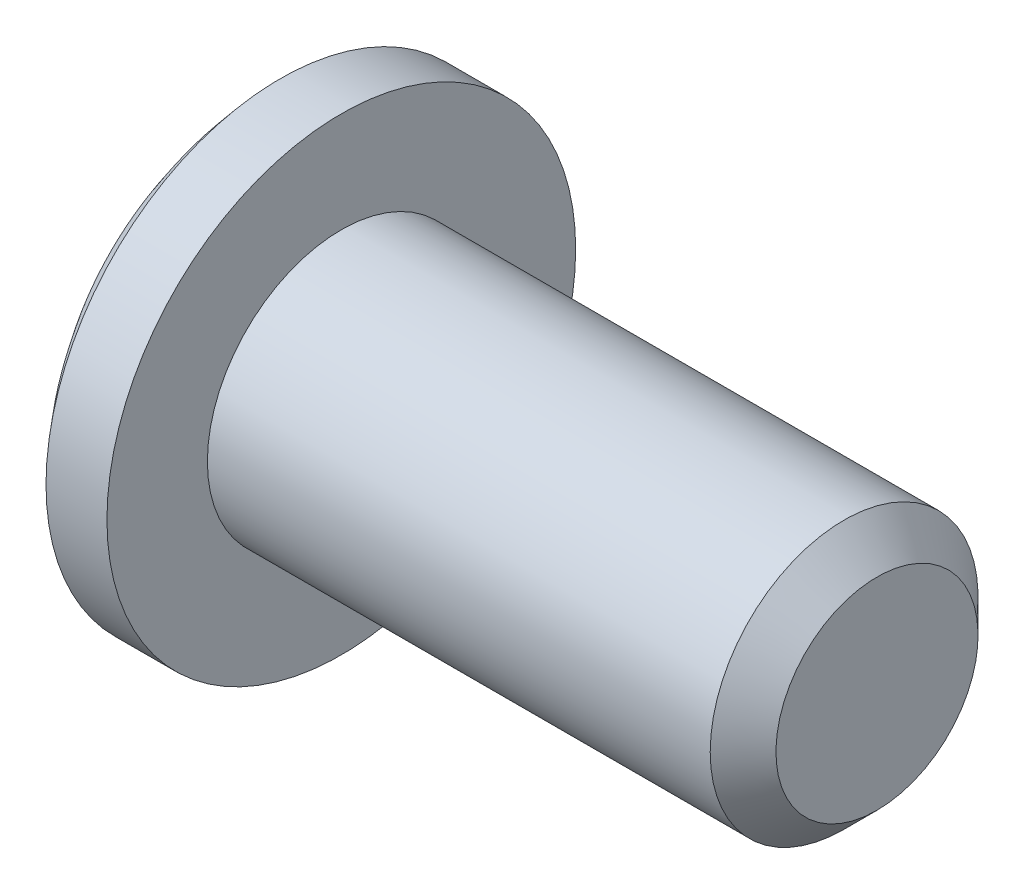
ISO-10303-21;
HEADER;
FILE_DESCRIPTION(('STEP AP214'),'2;1');
FILE_NAME('part.step','',(''),(''),'','','');
FILE_SCHEMA(('AUTOMOTIVE_DESIGN { 1 0 10303 214 1 1 1 1 }'));
ENDSEC;
DATA;
#1=APPLICATION_CONTEXT('core data for automotive mechanical design processes');
#2=APPLICATION_PROTOCOL_DEFINITION('international standard','automotive_design',2000,#1);
#3=PRODUCT_CONTEXT('',#1,'mechanical');
#4=PRODUCT('Part','Part','',(#3));
#5=PRODUCT_RELATED_PRODUCT_CATEGORY('part','',(#4));
#6=PRODUCT_DEFINITION_FORMATION('','',#4);
#7=PRODUCT_DEFINITION_CONTEXT('part definition',#1,'design');
#8=PRODUCT_DEFINITION('design','',#6,#7);
#9=PRODUCT_DEFINITION_SHAPE('','',#8);
#10=(LENGTH_UNIT() NAMED_UNIT(*) SI_UNIT(.MILLI.,.METRE.));
#11=(NAMED_UNIT(*) PLANE_ANGLE_UNIT() SI_UNIT($,.RADIAN.));
#12=(NAMED_UNIT(*) SI_UNIT($,.STERADIAN.) SOLID_ANGLE_UNIT());
#13=UNCERTAINTY_MEASURE_WITH_UNIT(LENGTH_MEASURE(1.E-05),#10,'distance_accuracy_value','');
#14=(GEOMETRIC_REPRESENTATION_CONTEXT(3) GLOBAL_UNCERTAINTY_ASSIGNED_CONTEXT((#13)) GLOBAL_UNIT_ASSIGNED_CONTEXT((#10,
#11,#12)) REPRESENTATION_CONTEXT('',''));
#15=CARTESIAN_POINT('',(0.,0.,0.));
#16=DIRECTION('',(0.,0.,1.));
#17=DIRECTION('',(1.,0.,0.));
#18=AXIS2_PLACEMENT_3D('',#15,#16,#17);
#19=CARTESIAN_POINT('',(-0.975,0.175,1.05));
#20=DIRECTION('',(-0.850265146687862,0.,-0.526354614616295));
#21=DIRECTION('',(-0.526354614616295,0.,0.850265146687862));
#22=AXIS2_PLACEMENT_3D('',#19,#20,#21);
#23=PLANE('',#22);
#24=DIRECTION('',(0.400997804009163,-0.647765683399418,-0.647765683399418));
#25=VECTOR('',#24,1.);
#26=CARTESIAN_POINT('',(-0.433333333333333,0.175,0.175));
#27=LINE('',#26,#25);
#28=CARTESIAN_POINT('',(-0.433333333333333,0.175,0.175));
#29=VERTEX_POINT('',#28);
#30=CARTESIAN_POINT('',(-0.325,0.,0.));
#31=VERTEX_POINT('',#30);
#32=EDGE_CURVE('E114',#29,#31,#27,.T.);
#33=ORIENTED_EDGE('',*,*,#32,.F.);
#34=DIRECTION('',(0.526354614616294,0.,-0.850265146687863));
#35=VECTOR('',#34,1.);
#36=CARTESIAN_POINT('',(-0.433333333333333,0.175,0.175));
#37=LINE('',#36,#35);
#38=CARTESIAN_POINT('',(-0.325,0.175,0.));
#39=VERTEX_POINT('',#38);
#40=EDGE_CURVE('E110',#29,#39,#37,.T.);
#41=ORIENTED_EDGE('',*,*,#40,.T.);
#42=DIRECTION('',(0.,1.,0.));
#43=VECTOR('',#42,1.);
#44=CARTESIAN_POINT('',(-0.325,0.175,0.));
#45=LINE('',#44,#43);
#46=EDGE_CURVE('E111',#31,#39,#45,.T.);
#47=ORIENTED_EDGE('',*,*,#46,.F.);
#48=EDGE_LOOP('',(#33,#41,#47));
#49=FACE_BOUND('',#48,.T.);
#50=ADVANCED_FACE('F16',(#49),#23,.T.);
#51=CARTESIAN_POINT('',(-0.325,0.175,0.));
#52=DIRECTION('',(-0.850265146687862,0.,0.526354614616295));
#53=DIRECTION('',(0.526354614616295,0.,0.850265146687862));
#54=AXIS2_PLACEMENT_3D('',#51,#52,#53);
#55=PLANE('',#54);
#56=DIRECTION('',(-0.400997804009163,0.647765683399417,-0.647765683399418));
#57=VECTOR('',#56,1.);
#58=CARTESIAN_POINT('',(-0.325,0.,0.));
#59=LINE('',#58,#57);
#60=CARTESIAN_POINT('',(-0.433333333333333,0.175,-0.175));
#61=VERTEX_POINT('',#60);
#62=EDGE_CURVE('E150',#31,#61,#59,.T.);
#63=ORIENTED_EDGE('',*,*,#62,.F.);
#64=ORIENTED_EDGE('',*,*,#46,.T.);
#65=DIRECTION('',(-0.526354614616294,0.,-0.850265146687863));
#66=VECTOR('',#65,1.);
#67=CARTESIAN_POINT('',(-0.325,0.175,0.));
#68=LINE('',#67,#66);
#69=EDGE_CURVE('E86',#39,#61,#68,.T.);
#70=ORIENTED_EDGE('',*,*,#69,.T.);
#71=EDGE_LOOP('',(#63,#64,#70));
#72=FACE_BOUND('',#71,.T.);
#73=ADVANCED_FACE('F151',(#72),#55,.T.);
#74=CARTESIAN_POINT('',(-0.975,-1.05,0.175));
#75=DIRECTION('',(-0.850265146687862,0.526354614616295,0.));
#76=DIRECTION('',(-0.526354614616295,-0.850265146687862,0.));
#77=AXIS2_PLACEMENT_3D('',#74,#75,#76);
#78=PLANE('',#77);
#79=DIRECTION('',(0.,0.,1.));
#80=VECTOR('',#79,1.);
#81=CARTESIAN_POINT('',(-0.325,0.,0.175));
#82=LINE('',#81,#80);
#83=CARTESIAN_POINT('',(-0.325,0.,0.175));
#84=VERTEX_POINT('',#83);
#85=EDGE_CURVE('E116',#31,#84,#82,.T.);
#86=ORIENTED_EDGE('',*,*,#85,.F.);
#87=DIRECTION('',(0.400997804009162,0.647765683399418,-0.647765683399417));
#88=VECTOR('',#87,1.);
#89=CARTESIAN_POINT('',(-0.433333333333333,-0.175,0.174999999999999));
#90=LINE('',#89,#88);
#91=CARTESIAN_POINT('',(-0.433333333333333,-0.175,0.175));
#92=VERTEX_POINT('',#91);
#93=EDGE_CURVE('E122',#92,#31,#90,.T.);
#94=ORIENTED_EDGE('',*,*,#93,.F.);
#95=DIRECTION('',(0.526354614616294,0.850265146687863,0.));
#96=VECTOR('',#95,1.);
#97=CARTESIAN_POINT('',(-0.433333333333333,-0.175,0.175));
#98=LINE('',#97,#96);
#99=EDGE_CURVE('E125',#92,#84,#98,.T.);
#100=ORIENTED_EDGE('',*,*,#99,.T.);
#101=EDGE_LOOP('',(#86,#94,#100));
#102=FACE_BOUND('',#101,.T.);
#103=ADVANCED_FACE('F121',(#102),#78,.T.);
#104=CARTESIAN_POINT('',(-0.325,0.,0.175));
#105=DIRECTION('',(-0.850265146687862,-0.526354614616295,0.));
#106=DIRECTION('',(0.526354614616295,-0.850265146687862,0.));
#107=AXIS2_PLACEMENT_3D('',#104,#105,#106);
#108=PLANE('',#107);
#109=DIRECTION('',(-0.526354614616294,0.850265146687863,0.));
#110=VECTOR('',#109,1.);
#111=CARTESIAN_POINT('',(-0.325,0.,0.175));
#112=LINE('',#111,#110);
#113=EDGE_CURVE('E163',#84,#29,#112,.T.);
#114=ORIENTED_EDGE('',*,*,#113,.T.);
#115=ORIENTED_EDGE('',*,*,#32,.T.);
#116=ORIENTED_EDGE('',*,*,#85,.T.);
#117=EDGE_LOOP('',(#114,#115,#116));
#118=FACE_BOUND('',#117,.T.);
#119=ADVANCED_FACE('F162',(#118),#108,.T.);
#120=CARTESIAN_POINT('',(-0.325,0.175,0.));
#121=DIRECTION('',(-0.850265146687862,0.,0.526354614616295));
#122=DIRECTION('',(0.526354614616295,0.,0.850265146687862));
#123=AXIS2_PLACEMENT_3D('',#120,#121,#122);
#124=PLANE('',#123);
#125=DIRECTION('',(0.400997804009162,0.647765683399417,0.647765683399418));
#126=VECTOR('',#125,1.);
#127=CARTESIAN_POINT('',(-0.433333333333333,-0.174999999999999,-0.175));
#128=LINE('',#127,#126);
#129=CARTESIAN_POINT('',(-0.433333333333333,-0.175,-0.175));
#130=VERTEX_POINT('',#129);
#131=EDGE_CURVE('E140',#130,#31,#128,.T.);
#132=ORIENTED_EDGE('',*,*,#131,.F.);
#133=DIRECTION('',(-0.526354614616294,0.,-0.850265146687863));
#134=VECTOR('',#133,1.);
#135=CARTESIAN_POINT('',(-0.325,-0.175,0.));
#136=LINE('',#135,#134);
#137=CARTESIAN_POINT('',(-0.325,-0.175,0.));
#138=VERTEX_POINT('',#137);
#139=EDGE_CURVE('E160',#138,#130,#136,.T.);
#140=ORIENTED_EDGE('',*,*,#139,.F.);
#141=DIRECTION('',(0.,1.,0.));
#142=VECTOR('',#141,1.);
#143=CARTESIAN_POINT('',(-0.325,0.175,0.));
#144=LINE('',#143,#142);
#145=EDGE_CURVE('E134',#31,#138,#144,.F.);
#146=ORIENTED_EDGE('',*,*,#145,.F.);
#147=EDGE_LOOP('',(#132,#140,#146));
#148=FACE_BOUND('',#147,.T.);
#149=ADVANCED_FACE('F159',(#148),#124,.T.);
#150=CARTESIAN_POINT('',(-0.975,0.175,1.05));
#151=DIRECTION('',(-0.850265146687862,0.,-0.526354614616295));
#152=DIRECTION('',(-0.526354614616295,0.,0.850265146687862));
#153=AXIS2_PLACEMENT_3D('',#150,#151,#152);
#154=PLANE('',#153);
#155=ORIENTED_EDGE('',*,*,#93,.T.);
#156=ORIENTED_EDGE('',*,*,#145,.T.);
#157=DIRECTION('',(0.526354614616294,0.,-0.850265146687863));
#158=VECTOR('',#157,1.);
#159=CARTESIAN_POINT('',(-0.433333333333333,-0.175,0.175));
#160=LINE('',#159,#158);
#161=EDGE_CURVE('E136',#92,#138,#160,.T.);
#162=ORIENTED_EDGE('',*,*,#161,.F.);
#163=EDGE_LOOP('',(#155,#156,#162));
#164=FACE_BOUND('',#163,.T.);
#165=ADVANCED_FACE('F132',(#164),#154,.T.);
#166=CARTESIAN_POINT('',(-0.975,-1.05,0.175));
#167=DIRECTION('',(-0.850265146687862,0.526354614616295,0.));
#168=DIRECTION('',(-0.526354614616295,-0.850265146687862,0.));
#169=AXIS2_PLACEMENT_3D('',#166,#167,#168);
#170=PLANE('',#169);
#171=DIRECTION('',(0.526354614616294,0.850265146687863,0.));
#172=VECTOR('',#171,1.);
#173=CARTESIAN_POINT('',(-0.433333333333333,-0.175,-0.175));
#174=LINE('',#173,#172);
#175=CARTESIAN_POINT('',(-0.325,0.,-0.175));
#176=VERTEX_POINT('',#175);
#177=EDGE_CURVE('E146',#130,#176,#174,.T.);
#178=ORIENTED_EDGE('',*,*,#177,.F.);
#179=ORIENTED_EDGE('',*,*,#131,.T.);
#180=DIRECTION('',(0.,0.,1.));
#181=VECTOR('',#180,1.);
#182=CARTESIAN_POINT('',(-0.325,0.,0.175));
#183=LINE('',#182,#181);
#184=EDGE_CURVE('E143',#176,#31,#183,.T.);
#185=ORIENTED_EDGE('',*,*,#184,.F.);
#186=EDGE_LOOP('',(#178,#179,#185));
#187=FACE_BOUND('',#186,.T.);
#188=ADVANCED_FACE('F141',(#187),#170,.T.);
#189=CARTESIAN_POINT('',(-0.325,0.,0.175));
#190=DIRECTION('',(-0.850265146687862,-0.526354614616295,0.));
#191=DIRECTION('',(0.526354614616295,-0.850265146687862,0.));
#192=AXIS2_PLACEMENT_3D('',#189,#190,#191);
#193=PLANE('',#192);
#194=ORIENTED_EDGE('',*,*,#184,.T.);
#195=ORIENTED_EDGE('',*,*,#62,.T.);
#196=DIRECTION('',(-0.526354614616294,0.850265146687863,0.));
#197=VECTOR('',#196,1.);
#198=CARTESIAN_POINT('',(-0.325,0.,-0.175));
#199=LINE('',#198,#197);
#200=EDGE_CURVE('E157',#176,#61,#199,.T.);
#201=ORIENTED_EDGE('',*,*,#200,.F.);
#202=EDGE_LOOP('',(#194,#195,#201));
#203=FACE_BOUND('',#202,.T.);
#204=ADVANCED_FACE('F155',(#203),#193,.T.);
#205=CARTESIAN_POINT('',(0.,0.175,0.));
#206=DIRECTION('',(0.,1.,0.));
#207=DIRECTION('',(0.,0.,1.));
#208=AXIS2_PLACEMENT_3D('',#205,#206,#207);
#209=PLANE('',#208);
#210=ORIENTED_EDGE('',*,*,#69,.F.);
#211=ORIENTED_EDGE('',*,*,#40,.F.);
#212=DIRECTION('',(0.,0.,1.));
#213=VECTOR('',#212,1.);
#214=CARTESIAN_POINT('',(-0.433333333333333,0.175,0.175));
#215=LINE('',#214,#213);
#216=EDGE_CURVE('E359',#61,#29,#215,.T.);
#217=ORIENTED_EDGE('',*,*,#216,.F.);
#218=EDGE_LOOP('',(#210,#211,#217));
#219=FACE_BOUND('',#218,.T.);
#220=ADVANCED_FACE('F427',(#219),#209,.F.);
#221=CARTESIAN_POINT('',(0.,0.,0.175));
#222=DIRECTION('',(0.,0.,1.));
#223=DIRECTION('',(1.,0.,0.));
#224=AXIS2_PLACEMENT_3D('',#221,#222,#223);
#225=PLANE('',#224);
#226=ORIENTED_EDGE('',*,*,#113,.F.);
#227=ORIENTED_EDGE('',*,*,#99,.F.);
#228=DIRECTION('',(0.,1.,0.));
#229=VECTOR('',#228,1.);
#230=CARTESIAN_POINT('',(-0.433333333333333,0.175,0.174999999999999));
#231=LINE('',#230,#229);
#232=EDGE_CURVE('E350',#29,#92,#231,.F.);
#233=ORIENTED_EDGE('',*,*,#232,.F.);
#234=EDGE_LOOP('',(#226,#227,#233));
#235=FACE_BOUND('',#234,.T.);
#236=ADVANCED_FACE('F588',(#235),#225,.F.);
#237=CARTESIAN_POINT('',(0.,-0.175,0.));
#238=DIRECTION('',(0.,1.,0.));
#239=DIRECTION('',(0.,0.,1.));
#240=AXIS2_PLACEMENT_3D('',#237,#238,#239);
#241=PLANE('',#240);
#242=DIRECTION('',(0.,0.,1.));
#243=VECTOR('',#242,1.);
#244=CARTESIAN_POINT('',(-0.433333333333333,-0.174999999999999,0.175));
#245=LINE('',#244,#243);
#246=EDGE_CURVE('E330',#92,#130,#245,.F.);
#247=ORIENTED_EDGE('',*,*,#246,.F.);
#248=ORIENTED_EDGE('',*,*,#161,.T.);
#249=ORIENTED_EDGE('',*,*,#139,.T.);
#250=EDGE_LOOP('',(#247,#248,#249));
#251=FACE_BOUND('',#250,.T.);
#252=ADVANCED_FACE('F420',(#251),#241,.T.);
#253=CARTESIAN_POINT('',(0.,0.,-0.175));
#254=DIRECTION('',(0.,0.,1.));
#255=DIRECTION('',(1.,0.,0.));
#256=AXIS2_PLACEMENT_3D('',#253,#254,#255);
#257=PLANE('',#256);
#258=ORIENTED_EDGE('',*,*,#200,.T.);
#259=DIRECTION('',(0.,1.,0.));
#260=VECTOR('',#259,1.);
#261=CARTESIAN_POINT('',(-0.433333333333333,0.175,-0.175));
#262=LINE('',#261,#260);
#263=EDGE_CURVE('E314',#130,#61,#262,.T.);
#264=ORIENTED_EDGE('',*,*,#263,.F.);
#265=ORIENTED_EDGE('',*,*,#177,.T.);
#266=EDGE_LOOP('',(#258,#264,#265));
#267=FACE_BOUND('',#266,.T.);
#268=ADVANCED_FACE('F430',(#267),#257,.T.);
#269=CARTESIAN_POINT('',(-0.325,0.,0.175));
#270=DIRECTION('',(-0.850265146687862,-0.526354614616295,0.));
#271=DIRECTION('',(0.526354614616295,-0.850265146687862,0.));
#272=AXIS2_PLACEMENT_3D('',#269,#270,#271);
#273=PLANE('',#272);
#274=DIRECTION('',(-0.526354614616296,0.850265146687861,0.));
#275=VECTOR('',#274,1.);
#276=CARTESIAN_POINT('',(-0.433333333333333,0.175,0.175));
#277=LINE('',#276,#275);
#278=CARTESIAN_POINT('',(-0.953506304283656,1.01527941461206,0.175));
#279=VERTEX_POINT('',#278);
#280=EDGE_CURVE('E355',#29,#279,#277,.T.);
#281=ORIENTED_EDGE('',*,*,#280,.T.);
#282=CARTESIAN_POINT('',(-0.953506304283655,1.01527941461206,-0.175));
#283=CARTESIAN_POINT('',(-0.956325241406294,1.01983308227171,-0.116666666666667));
#284=CARTESIAN_POINT('',(-0.957734709967613,1.02210991610153,-0.0583333333333334));
#285=CARTESIAN_POINT('',(-0.957734709967613,1.02210991610153,0.0583333333333332));
#286=CARTESIAN_POINT('',(-0.956325241406294,1.01983308227171,0.116666666666667));
#287=CARTESIAN_POINT('',(-0.953506304283655,1.01527941461206,0.175));
#288=B_SPLINE_CURVE_WITH_KNOTS('',3,(#282,#283,#284,#285,#286,#287),.UNSPECIFIED.,.F.,.F.,(4,2,
4),(0.,0.175184289150671,0.350368578301341),.UNSPECIFIED.);
#289=CARTESIAN_POINT('',(-0.953506304283656,1.01527941461206,-0.175));
#290=VERTEX_POINT('',#289);
#291=EDGE_CURVE('E21',#290,#279,#288,.T.);
#292=ORIENTED_EDGE('',*,*,#291,.F.);
#293=DIRECTION('',(-0.526354614616296,0.850265146687861,0.));
#294=VECTOR('',#293,1.);
#295=CARTESIAN_POINT('',(-0.433333333333333,0.175,-0.175));
#296=LINE('',#295,#294);
#297=EDGE_CURVE('E301',#61,#290,#296,.T.);
#298=ORIENTED_EDGE('',*,*,#297,.F.);
#299=ORIENTED_EDGE('',*,*,#216,.T.);
#300=EDGE_LOOP('',(#281,#292,#298,#299));
#301=FACE_BOUND('',#300,.T.);
#302=ADVANCED_FACE('F289',(#301),#273,.T.);
#303=CARTESIAN_POINT('',(0.,0.,0.175));
#304=DIRECTION('',(0.,0.,1.));
#305=DIRECTION('',(1.,0.,0.));
#306=AXIS2_PLACEMENT_3D('',#303,#304,#305);
#307=PLANE('',#306);
#308=ORIENTED_EDGE('',*,*,#280,.F.);
#309=DIRECTION('',(1.,0.,0.));
#310=VECTOR('',#309,1.);
#311=CARTESIAN_POINT('',(0.,0.175,0.175));
#312=LINE('',#311,#310);
#313=CARTESIAN_POINT('',(-1.24863463291936,0.175,0.175000000000005));
#314=VERTEX_POINT('',#313);
#315=EDGE_CURVE('E353',#29,#314,#312,.F.);
#316=ORIENTED_EDGE('',*,*,#315,.T.);
#317=CARTESIAN_POINT('',(-0.953506304283655,1.01527941461206,0.175));
#318=CARTESIAN_POINT('',(-0.987572627450665,0.948900720239734,0.175));
#319=CARTESIAN_POINT('',(-1.01951562997171,0.881408808395306,0.175));
#320=CARTESIAN_POINT('',(-1.07873397734126,0.744812618336349,0.175));
#321=CARTESIAN_POINT('',(-1.10603200095834,0.67571816248455,0.175));
#322=CARTESIAN_POINT('',(-1.1434377424404,0.570783140441776,0.175));
#323=CARTESIAN_POINT('',(-1.15532180777466,0.535569021371972,0.175));
#324=CARTESIAN_POINT('',(-1.17783289828711,0.464745347420274,0.175));
#325=CARTESIAN_POINT('',(-1.18846011125578,0.42913585248472,0.175));
#326=CARTESIAN_POINT('',(-1.20839214167713,0.357350205990634,0.175));
#327=CARTESIAN_POINT('',(-1.21768997621764,0.321172096075203,0.175));
#328=CARTESIAN_POINT('',(-1.23037595658623,0.266602988912237,0.175));
#329=CARTESIAN_POINT('',(-1.2343952892844,0.248358613339297,0.175));
#330=CARTESIAN_POINT('',(-1.24192204080016,0.211761530192872,0.175));
#331=CARTESIAN_POINT('',(-1.24542936601355,0.193408803447326,0.175));
#332=CARTESIAN_POINT('',(-1.24863463291939,0.17500000000001,0.175));
#333=B_SPLINE_CURVE_WITH_KNOTS('',3,(#317,#318,#319,#320,#321,#322,#323,#324,#325,#326,#327,
#328,#329,#330,#331,#332),.UNSPECIFIED.,.F.,.F.,(4,2,2,2,2,2,2,4),(0.,0.22382818069196,
0.446530060827351,0.558006791016394,0.66946684399988,0.781492404353103,0.837531690908899,
0.893581209662638),.UNSPECIFIED.);
#334=EDGE_CURVE('E293',#279,#314,#333,.T.);
#335=ORIENTED_EDGE('',*,*,#334,.F.);
#336=EDGE_LOOP('',(#308,#316,#335));
#337=FACE_BOUND('',#336,.T.);
#338=ADVANCED_FACE('F285',(#337),#307,.F.);
#339=CARTESIAN_POINT('',(0.,0.175,0.));
#340=DIRECTION('',(0.,1.,0.));
#341=DIRECTION('',(0.,0.,1.));
#342=AXIS2_PLACEMENT_3D('',#339,#340,#341);
#343=PLANE('',#342);
#344=ORIENTED_EDGE('',*,*,#315,.F.);
#345=DIRECTION('',(-0.526354614616295,0.,0.850265146687862));
#346=VECTOR('',#345,1.);
#347=CARTESIAN_POINT('',(-0.975,0.175,1.05));
#348=LINE('',#347,#346);
#349=CARTESIAN_POINT('',(-0.953506304283381,0.175000000000047,1.01527941461162));
#350=VERTEX_POINT('',#349);
#351=EDGE_CURVE('E345',#350,#29,#348,.F.);
#352=ORIENTED_EDGE('',*,*,#351,.F.);
#353=CARTESIAN_POINT('',(-1.24863463291939,0.175,0.17500000000001));
#354=CARTESIAN_POINT('',(-1.2450266510199,0.175,0.195699889806876));
#355=CARTESIAN_POINT('',(-1.24104200878714,0.175,0.216329242285938));
#356=CARTESIAN_POINT('',(-1.23244016673215,0.175,0.257449936535082));
#357=CARTESIAN_POINT('',(-1.22782315329184,0.175,0.277941317110195));
#358=CARTESIAN_POINT('',(-1.21323093382132,0.175,0.339105928910582));
#359=CARTESIAN_POINT('',(-1.20249094054413,0.175,0.379596492070197));
#360=CARTESIAN_POINT('',(-1.17616549719935,0.175,0.471050344698795));
#361=CARTESIAN_POINT('',(-1.16005703693311,0.175,0.521862327560565));
#362=CARTESIAN_POINT('',(-1.12536157212555,0.175,0.622643378612999));
#363=CARTESIAN_POINT('',(-1.10677398071931,0.175,0.672612244054358));
#364=CARTESIAN_POINT('',(-1.06708966261493,0.175,0.772001751613238));
#365=CARTESIAN_POINT('',(-1.04597423487706,0.175,0.821414920688566));
#366=CARTESIAN_POINT('',(-1.00144471833868,0.175,0.919169259643959));
#367=CARTESIAN_POINT('',(-0.978031614554672,0.175,0.967510878097432));
#368=CARTESIAN_POINT('',(-0.953506304283899,0.175,1.01527941461158));
#369=B_SPLINE_CURVE_WITH_KNOTS('',3,(#353,#354,#355,#356,#357,#358,#359,#360,#361,#362,#363,
#364,#365,#366,#367,#368),.UNSPECIFIED.,.F.,.F.,(4,2,2,2,2,2,2,4),(0.,0.063025130249932,
0.126031724601919,0.251658307960838,0.411501302400325,0.571382202576815,0.732528971172149,
0.893606955258883),.UNSPECIFIED.);
#370=EDGE_CURVE('E272',#314,#350,#369,.T.);
#371=ORIENTED_EDGE('',*,*,#370,.F.);
#372=EDGE_LOOP('',(#344,#352,#371));
#373=FACE_BOUND('',#372,.T.);
#374=ADVANCED_FACE('F280',(#373),#343,.F.);
#375=CARTESIAN_POINT('',(-0.975,0.175,1.05));
#376=DIRECTION('',(-0.850265146687862,0.,-0.526354614616295));
#377=DIRECTION('',(-0.526354614616295,0.,0.850265146687862));
#378=AXIS2_PLACEMENT_3D('',#375,#376,#377);
#379=PLANE('',#378);
#380=CARTESIAN_POINT('',(-0.953506304283651,0.175000000000094,1.01527941461205));
#381=CARTESIAN_POINT('',(-0.956325241406292,0.11666666666673,1.0198330822717));
#382=CARTESIAN_POINT('',(-0.957734709967613,0.058333333333365,1.02210991610153));
#383=CARTESIAN_POINT('',(-0.957734709967613,-0.0583333333333644,1.02210991610153));
#384=CARTESIAN_POINT('',(-0.956325241406292,-0.116666666666729,1.0198330822717));
#385=CARTESIAN_POINT('',(-0.953506304283651,-0.175000000000094,1.01527941461205));
#386=B_SPLINE_CURVE_WITH_KNOTS('',3,(#380,#381,#382,#383,#384,#385),.UNSPECIFIED.,.F.,.F.,(4,2,
4),(0.,0.175184289150765,0.35036857830153),.UNSPECIFIED.);
#387=CARTESIAN_POINT('',(-0.953506304283506,-0.175,1.01527941461138));
#388=VERTEX_POINT('',#387);
#389=EDGE_CURVE('E266',#350,#388,#386,.T.);
#390=ORIENTED_EDGE('',*,*,#389,.F.);
#391=ORIENTED_EDGE('',*,*,#351,.T.);
#392=ORIENTED_EDGE('',*,*,#232,.T.);
#393=DIRECTION('',(0.526354614616296,0.,-0.850265146687861));
#394=VECTOR('',#393,1.);
#395=CARTESIAN_POINT('',(-0.953506304283112,-0.175,1.01527941461118));
#396=LINE('',#395,#394);
#397=EDGE_CURVE('E340',#388,#92,#396,.T.);
#398=ORIENTED_EDGE('',*,*,#397,.F.);
#399=EDGE_LOOP('',(#390,#391,#392,#398));
#400=FACE_BOUND('',#399,.T.);
#401=ADVANCED_FACE('F277',(#400),#379,.T.);
#402=CARTESIAN_POINT('',(0.,-0.175,0.));
#403=DIRECTION('',(0.,1.,0.));
#404=DIRECTION('',(0.,0.,1.));
#405=AXIS2_PLACEMENT_3D('',#402,#403,#404);
#406=PLANE('',#405);
#407=CARTESIAN_POINT('',(-0.953506304283899,-0.175,1.01527941461158));
#408=CARTESIAN_POINT('',(-0.987572627450879,-0.175,0.948900720239294));
#409=CARTESIAN_POINT('',(-1.01951562997189,-0.175,0.881408808394901));
#410=CARTESIAN_POINT('',(-1.07873397734139,-0.175,0.744812618336019));
#411=CARTESIAN_POINT('',(-1.10603200095845,-0.175,0.675718162484259));
#412=CARTESIAN_POINT('',(-1.14343774244048,-0.175,0.570783140441544));
#413=CARTESIAN_POINT('',(-1.15532180777473,-0.175,0.53556902137176));
#414=CARTESIAN_POINT('',(-1.17783289828716,-0.175,0.464745347420103));
#415=CARTESIAN_POINT('',(-1.18846011125582,-0.175,0.429135852484569));
#416=CARTESIAN_POINT('',(-1.20839214167716,-0.175,0.357350205990526));
#417=CARTESIAN_POINT('',(-1.21768997621766,-0.175,0.321172096075116));
#418=CARTESIAN_POINT('',(-1.23037595658624,-0.175,0.266602988912182));
#419=CARTESIAN_POINT('',(-1.23439528928441,-0.175,0.248358613339254));
#420=CARTESIAN_POINT('',(-1.24192204080017,-0.175,0.21176153019285));
#421=CARTESIAN_POINT('',(-1.24542936601355,-0.175,0.193408803447315));
#422=CARTESIAN_POINT('',(-1.24863463291939,-0.175,0.17500000000001));
#423=B_SPLINE_CURVE_WITH_KNOTS('',3,(#407,#408,#409,#410,#411,#412,#413,#414,#415,#416,#417,
#418,#419,#420,#421,#422),.UNSPECIFIED.,.F.,.F.,(4,2,2,2,2,2,2,4),(0.,0.223828180691825,
0.446530060827084,0.558006791016061,0.66946684399948,0.781492404352636,0.837531690908398,
0.893581209662103),.UNSPECIFIED.);
#424=CARTESIAN_POINT('',(-1.24863463291936,-0.175000000000005,0.175));
#425=VERTEX_POINT('',#424);
#426=EDGE_CURVE('E260',#388,#425,#423,.T.);
#427=ORIENTED_EDGE('',*,*,#426,.F.);
#428=ORIENTED_EDGE('',*,*,#397,.T.);
#429=DIRECTION('',(1.,0.,0.));
#430=VECTOR('',#429,1.);
#431=CARTESIAN_POINT('',(0.,-0.175,0.175));
#432=LINE('',#431,#430);
#433=EDGE_CURVE('E336',#92,#425,#432,.F.);
#434=ORIENTED_EDGE('',*,*,#433,.T.);
#435=EDGE_LOOP('',(#427,#428,#434));
#436=FACE_BOUND('',#435,.T.);
#437=ADVANCED_FACE('F250',(#436),#406,.T.);
#438=CARTESIAN_POINT('',(0.,0.,0.175));
#439=DIRECTION('',(0.,0.,1.));
#440=DIRECTION('',(1.,0.,0.));
#441=AXIS2_PLACEMENT_3D('',#438,#439,#440);
#442=PLANE('',#441);
#443=ORIENTED_EDGE('',*,*,#433,.F.);
#444=DIRECTION('',(-0.526354614616295,-0.850265146687862,0.));
#445=VECTOR('',#444,1.);
#446=CARTESIAN_POINT('',(-0.975,-1.05,0.175));
#447=LINE('',#446,#445);
#448=CARTESIAN_POINT('',(-0.953506304283381,-1.01527941461162,0.175000000000047));
#449=VERTEX_POINT('',#448);
#450=EDGE_CURVE('E333',#449,#92,#447,.F.);
#451=ORIENTED_EDGE('',*,*,#450,.F.);
#452=CARTESIAN_POINT('',(-1.24863463291939,-0.17500000000001,0.175));
#453=CARTESIAN_POINT('',(-1.2450266510199,-0.195699889806876,0.175));
#454=CARTESIAN_POINT('',(-1.24104200878714,-0.216329242285938,0.175));
#455=CARTESIAN_POINT('',(-1.23244016673215,-0.257449936535082,0.175));
#456=CARTESIAN_POINT('',(-1.22782315329184,-0.277941317110195,0.175));
#457=CARTESIAN_POINT('',(-1.21323093382132,-0.339105928910582,0.175));
#458=CARTESIAN_POINT('',(-1.20249094054413,-0.379596492070197,0.175));
#459=CARTESIAN_POINT('',(-1.17616549719935,-0.471050344698795,0.175));
#460=CARTESIAN_POINT('',(-1.16005703693311,-0.521862327560565,0.175));
#461=CARTESIAN_POINT('',(-1.12536157212555,-0.622643378612999,0.175));
#462=CARTESIAN_POINT('',(-1.10677398071931,-0.672612244054358,0.175));
#463=CARTESIAN_POINT('',(-1.06708966261493,-0.772001751613238,0.175));
#464=CARTESIAN_POINT('',(-1.04597423487706,-0.821414920688566,0.175));
#465=CARTESIAN_POINT('',(-1.00144471833868,-0.919169259643959,0.175));
#466=CARTESIAN_POINT('',(-0.978031614554672,-0.967510878097432,0.175));
#467=CARTESIAN_POINT('',(-0.953506304283899,-1.01527941461158,0.175));
#468=B_SPLINE_CURVE_WITH_KNOTS('',3,(#452,#453,#454,#455,#456,#457,#458,#459,#460,#461,#462,
#463,#464,#465,#466,#467),.UNSPECIFIED.,.F.,.F.,(4,2,2,2,2,2,2,4),(0.,0.063025130249932,
0.126031724601919,0.251658307960838,0.411501302400325,0.571382202576815,0.732528971172149,
0.893606955258883),.UNSPECIFIED.);
#469=EDGE_CURVE('E254',#425,#449,#468,.T.);
#470=ORIENTED_EDGE('',*,*,#469,.F.);
#471=EDGE_LOOP('',(#443,#451,#470));
#472=FACE_BOUND('',#471,.T.);
#473=ADVANCED_FACE('F245',(#472),#442,.F.);
#474=CARTESIAN_POINT('',(-0.975,-1.05,0.175));
#475=DIRECTION('',(-0.850265146687862,0.526354614616295,0.));
#476=DIRECTION('',(-0.526354614616295,-0.850265146687862,0.));
#477=AXIS2_PLACEMENT_3D('',#474,#475,#476);
#478=PLANE('',#477);
#479=DIRECTION('',(0.526354614616296,0.850265146687861,0.));
#480=VECTOR('',#479,1.);
#481=CARTESIAN_POINT('',(-0.953506304283112,-1.01527941461118,-0.175));
#482=LINE('',#481,#480);
#483=CARTESIAN_POINT('',(-0.953506304283506,-1.01527941461138,-0.175));
#484=VERTEX_POINT('',#483);
#485=EDGE_CURVE('E325',#484,#130,#482,.T.);
#486=ORIENTED_EDGE('',*,*,#485,.F.);
#487=CARTESIAN_POINT('',(-0.95350630428365,-1.01527941461205,0.175000000000094));
#488=CARTESIAN_POINT('',(-0.956325241406292,-1.0198330822717,0.116666666666729));
#489=CARTESIAN_POINT('',(-0.957734709967613,-1.02210991610153,0.0583333333333645));
#490=CARTESIAN_POINT('',(-0.957734709967613,-1.02210991610153,-0.058333333333365));
#491=CARTESIAN_POINT('',(-0.956325241406292,-1.0198330822717,-0.11666666666673));
#492=CARTESIAN_POINT('',(-0.95350630428365,-1.01527941461205,-0.175000000000094));
#493=B_SPLINE_CURVE_WITH_KNOTS('',3,(#487,#488,#489,#490,#491,#492),.UNSPECIFIED.,.F.,.F.,(4,2,
4),(0.,0.175184289150765,0.35036857830153),.UNSPECIFIED.);
#494=EDGE_CURVE('E231',#449,#484,#493,.T.);
#495=ORIENTED_EDGE('',*,*,#494,.F.);
#496=ORIENTED_EDGE('',*,*,#450,.T.);
#497=ORIENTED_EDGE('',*,*,#246,.T.);
#498=EDGE_LOOP('',(#486,#495,#496,#497));
#499=FACE_BOUND('',#498,.T.);
#500=ADVANCED_FACE('F240',(#499),#478,.T.);
#501=CARTESIAN_POINT('',(0.,0.,-0.175));
#502=DIRECTION('',(0.,0.,1.));
#503=DIRECTION('',(1.,0.,0.));
#504=AXIS2_PLACEMENT_3D('',#501,#502,#503);
#505=PLANE('',#504);
#506=DIRECTION('',(1.,0.,0.));
#507=VECTOR('',#506,1.);
#508=CARTESIAN_POINT('',(0.,-0.175,-0.175));
#509=LINE('',#508,#507);
#510=CARTESIAN_POINT('',(-1.24863463291939,-0.175,-0.175));
#511=VERTEX_POINT('',#510);
#512=EDGE_CURVE('E320',#511,#130,#509,.T.);
#513=ORIENTED_EDGE('',*,*,#512,.F.);
#514=CARTESIAN_POINT('',(-0.953506304283899,-1.01527941461158,-0.175));
#515=CARTESIAN_POINT('',(-0.987572627450879,-0.948900720239292,-0.175));
#516=CARTESIAN_POINT('',(-1.01951562997189,-0.881408808394899,-0.175));
#517=CARTESIAN_POINT('',(-1.07873397734139,-0.744812618336016,-0.175));
#518=CARTESIAN_POINT('',(-1.10603200095845,-0.675718162484254,-0.175));
#519=CARTESIAN_POINT('',(-1.14343774244048,-0.570783140441538,-0.175));
#520=CARTESIAN_POINT('',(-1.15532180777473,-0.535569021371754,-0.175));
#521=CARTESIAN_POINT('',(-1.17783289828717,-0.464745347420096,-0.175));
#522=CARTESIAN_POINT('',(-1.18846011125582,-0.429135852484562,-0.175));
#523=CARTESIAN_POINT('',(-1.20839214167716,-0.357350205990518,-0.175));
#524=CARTESIAN_POINT('',(-1.21768997621766,-0.321172096075108,-0.175));
#525=CARTESIAN_POINT('',(-1.23037595658624,-0.266602988912173,-0.175));
#526=CARTESIAN_POINT('',(-1.23439528928441,-0.248358613339244,-0.175));
#527=CARTESIAN_POINT('',(-1.24192204080017,-0.21176153019284,-0.175));
#528=CARTESIAN_POINT('',(-1.24542936601355,-0.193408803447305,-0.175));
#529=CARTESIAN_POINT('',(-1.24863463291939,-0.175,-0.175));
#530=B_SPLINE_CURVE_WITH_KNOTS('',3,(#514,#515,#516,#517,#518,#519,#520,#521,#522,#523,#524,
#525,#526,#527,#528,#529),.UNSPECIFIED.,.F.,.F.,(4,2,2,2,2,2,2,4),(0.,0.223828180691828,
0.446530060827089,0.558006791016068,0.669466843999488,0.781492404352645,0.837531690908408,
0.893581209662113),.UNSPECIFIED.);
#531=EDGE_CURVE('E225',#484,#511,#530,.T.);
#532=ORIENTED_EDGE('',*,*,#531,.F.);
#533=ORIENTED_EDGE('',*,*,#485,.T.);
#534=EDGE_LOOP('',(#513,#532,#533));
#535=FACE_BOUND('',#534,.T.);
#536=ADVANCED_FACE('F237',(#535),#505,.T.);
#537=CARTESIAN_POINT('',(0.,-0.175,0.));
#538=DIRECTION('',(0.,1.,0.));
#539=DIRECTION('',(0.,0.,1.));
#540=AXIS2_PLACEMENT_3D('',#537,#538,#539);
#541=PLANE('',#540);
#542=ORIENTED_EDGE('',*,*,#512,.T.);
#543=DIRECTION('',(0.526354614616295,0.,0.850265146687862));
#544=VECTOR('',#543,1.);
#545=CARTESIAN_POINT('',(-0.325,-0.175,0.));
#546=LINE('',#545,#544);
#547=CARTESIAN_POINT('',(-0.953506304283656,-0.175,-1.01527941461206));
#548=VERTEX_POINT('',#547);
#549=EDGE_CURVE('E317',#548,#130,#546,.T.);
#550=ORIENTED_EDGE('',*,*,#549,.F.);
#551=CARTESIAN_POINT('',(-1.24863463291939,-0.175,-0.175));
#552=CARTESIAN_POINT('',(-1.2450266510199,-0.175,-0.195699889806866));
#553=CARTESIAN_POINT('',(-1.24104200878715,-0.175,-0.216329242285927));
#554=CARTESIAN_POINT('',(-1.23244016673215,-0.175,-0.257449936535069));
#555=CARTESIAN_POINT('',(-1.22782315329185,-0.175,-0.277941317110182));
#556=CARTESIAN_POINT('',(-1.21323093382132,-0.175,-0.339105928910567));
#557=CARTESIAN_POINT('',(-1.20249094054414,-0.175,-0.379596492070182));
#558=CARTESIAN_POINT('',(-1.17616549719934,-0.175,-0.471050344698823));
#559=CARTESIAN_POINT('',(-1.16005703693309,-0.175,-0.521862327560636));
#560=CARTESIAN_POINT('',(-1.1253615721255,-0.175,-0.622643378613154));
#561=CARTESIAN_POINT('',(-1.10677398071923,-0.175,-0.672612244054554));
#562=CARTESIAN_POINT('',(-1.06708966261482,-0.175,-0.772001751613517));
#563=CARTESIAN_POINT('',(-1.04597423487692,-0.175,-0.821414920688886));
#564=CARTESIAN_POINT('',(-1.00144471833849,-0.175,-0.919169259644358));
#565=CARTESIAN_POINT('',(-0.978031614554456,-0.175,-0.967510878097869));
#566=CARTESIAN_POINT('',(-0.953506304283655,-0.175,-1.01527941461206));
#567=B_SPLINE_CURVE_WITH_KNOTS('',3,(#551,#552,#553,#554,#555,#556,#557,#558,#559,#560,#561,
#562,#563,#564,#565,#566),.UNSPECIFIED.,.F.,.F.,(4,2,2,2,2,2,2,4),(0.,0.0630251302499304,
0.126031724601916,0.251658307960831,0.411501302400455,0.571382202577081,0.732528971172554,
0.893606955259427),.UNSPECIFIED.);
#568=EDGE_CURVE('E219',#511,#548,#567,.T.);
#569=ORIENTED_EDGE('',*,*,#568,.F.);
#570=EDGE_LOOP('',(#542,#550,#569));
#571=FACE_BOUND('',#570,.T.);
#572=ADVANCED_FACE('F209',(#571),#541,.T.);
#573=CARTESIAN_POINT('',(-0.325,0.175,0.));
#574=DIRECTION('',(-0.850265146687862,0.,0.526354614616295));
#575=DIRECTION('',(0.526354614616295,0.,0.850265146687862));
#576=AXIS2_PLACEMENT_3D('',#573,#574,#575);
#577=PLANE('',#576);
#578=DIRECTION('',(-0.526354614616296,0.,-0.850265146687861));
#579=VECTOR('',#578,1.);
#580=CARTESIAN_POINT('',(-0.433333333333333,0.175,-0.175));
#581=LINE('',#580,#579);
#582=CARTESIAN_POINT('',(-0.953506304283656,0.175,-1.01527941461206));
#583=VERTEX_POINT('',#582);
#584=EDGE_CURVE('E303',#61,#583,#581,.T.);
#585=ORIENTED_EDGE('',*,*,#584,.T.);
#586=CARTESIAN_POINT('',(-0.953506304283655,-0.175,-1.01527941461206));
#587=CARTESIAN_POINT('',(-0.956325241406294,-0.116666666666667,-1.01983308227171));
#588=CARTESIAN_POINT('',(-0.957734709967613,-0.0583333333333334,-1.02210991610153));
#589=CARTESIAN_POINT('',(-0.957734709967613,0.0583333333333333,-1.02210991610153));
#590=CARTESIAN_POINT('',(-0.956325241406294,0.116666666666667,-1.01983308227171));
#591=CARTESIAN_POINT('',(-0.953506304283655,0.175,-1.01527941461206));
#592=B_SPLINE_CURVE_WITH_KNOTS('',3,(#586,#587,#588,#589,#590,#591),.UNSPECIFIED.,.F.,.F.,(4,2,
4),(0.,0.175184289150671,0.350368578301341),.UNSPECIFIED.);
#593=EDGE_CURVE('E213',#548,#583,#592,.T.);
#594=ORIENTED_EDGE('',*,*,#593,.F.);
#595=ORIENTED_EDGE('',*,*,#549,.T.);
#596=ORIENTED_EDGE('',*,*,#263,.T.);
#597=EDGE_LOOP('',(#585,#594,#595,#596));
#598=FACE_BOUND('',#597,.T.);
#599=ADVANCED_FACE('F205',(#598),#577,.T.);
#600=CARTESIAN_POINT('',(0.,0.175,0.));
#601=DIRECTION('',(0.,1.,0.));
#602=DIRECTION('',(0.,0.,1.));
#603=AXIS2_PLACEMENT_3D('',#600,#601,#602);
#604=PLANE('',#603);
#605=CARTESIAN_POINT('',(-0.953506304283655,0.175,-1.01527941461206));
#606=CARTESIAN_POINT('',(-0.987572627450666,0.175,-0.948900720239733));
#607=CARTESIAN_POINT('',(-1.01951562997171,0.175,-0.881408808395304));
#608=CARTESIAN_POINT('',(-1.07873397734126,0.175,-0.744812618336346));
#609=CARTESIAN_POINT('',(-1.10603200095834,0.175,-0.675718162484546));
#610=CARTESIAN_POINT('',(-1.1434377424404,0.175,-0.570783140441771));
#611=CARTESIAN_POINT('',(-1.15532180777466,0.175,-0.535569021371966));
#612=CARTESIAN_POINT('',(-1.17783289828711,0.175,-0.464745347420268));
#613=CARTESIAN_POINT('',(-1.18846011125578,0.175,-0.429135852484713));
#614=CARTESIAN_POINT('',(-1.20839214167713,0.175,-0.357350205990627));
#615=CARTESIAN_POINT('',(-1.21768997621764,0.175,-0.321172096075195));
#616=CARTESIAN_POINT('',(-1.23037595658623,0.175,-0.266602988912228));
#617=CARTESIAN_POINT('',(-1.2343952892844,0.175,-0.248358613339288));
#618=CARTESIAN_POINT('',(-1.24192204080017,0.175,-0.211761530192863));
#619=CARTESIAN_POINT('',(-1.24542936601355,0.175,-0.193408803447316));
#620=CARTESIAN_POINT('',(-1.24863463291939,0.175,-0.175));
#621=B_SPLINE_CURVE_WITH_KNOTS('',3,(#605,#606,#607,#608,#609,#610,#611,#612,#613,#614,#615,
#616,#617,#618,#619,#620),.UNSPECIFIED.,.F.,.F.,(4,2,2,2,2,2,2,4),(0.,0.223828180691962,
0.446530060827356,0.5580067910164,0.669466843999887,0.781492404353112,0.837531690908908,
0.893581209662647),.UNSPECIFIED.);
#622=CARTESIAN_POINT('',(-1.24863463291939,0.175,-0.175));
#623=VERTEX_POINT('',#622);
#624=EDGE_CURVE('E188',#583,#623,#621,.T.);
#625=ORIENTED_EDGE('',*,*,#624,.F.);
#626=ORIENTED_EDGE('',*,*,#584,.F.);
#627=DIRECTION('',(1.,0.,0.));
#628=VECTOR('',#627,1.);
#629=CARTESIAN_POINT('',(0.,0.175,-0.175));
#630=LINE('',#629,#628);
#631=EDGE_CURVE('E40',#623,#61,#630,.T.);
#632=ORIENTED_EDGE('',*,*,#631,.F.);
#633=EDGE_LOOP('',(#625,#626,#632));
#634=FACE_BOUND('',#633,.T.);
#635=ADVANCED_FACE('F198',(#634),#604,.F.);
#636=CARTESIAN_POINT('',(0.,0.,-0.175));
#637=DIRECTION('',(0.,0.,1.));
#638=DIRECTION('',(1.,0.,0.));
#639=AXIS2_PLACEMENT_3D('',#636,#637,#638);
#640=PLANE('',#639);
#641=ORIENTED_EDGE('',*,*,#297,.T.);
#642=CARTESIAN_POINT('',(-1.24863463291939,0.175,-0.175));
#643=CARTESIAN_POINT('',(-1.2450266510199,0.195699889806866,-0.175));
#644=CARTESIAN_POINT('',(-1.24104200878714,0.216329242285927,-0.175));
#645=CARTESIAN_POINT('',(-1.23244016673215,0.257449936535069,-0.175));
#646=CARTESIAN_POINT('',(-1.22782315329185,0.277941317110182,-0.175));
#647=CARTESIAN_POINT('',(-1.21323093382132,0.339105928910567,-0.175));
#648=CARTESIAN_POINT('',(-1.20249094054414,0.379596492070182,-0.175));
#649=CARTESIAN_POINT('',(-1.17616549719934,0.471050344698823,-0.175));
#650=CARTESIAN_POINT('',(-1.16005703693309,0.521862327560636,-0.175));
#651=CARTESIAN_POINT('',(-1.1253615721255,0.622643378613154,-0.175));
#652=CARTESIAN_POINT('',(-1.10677398071923,0.672612244054554,-0.175));
#653=CARTESIAN_POINT('',(-1.06708966261482,0.772001751613517,-0.175));
#654=CARTESIAN_POINT('',(-1.04597423487692,0.821414920688886,-0.175));
#655=CARTESIAN_POINT('',(-1.0014447183385,0.919169259644358,-0.175));
#656=CARTESIAN_POINT('',(-0.978031614554456,0.967510878097869,-0.175));
#657=CARTESIAN_POINT('',(-0.953506304283655,1.01527941461206,-0.175));
#658=B_SPLINE_CURVE_WITH_KNOTS('',3,(#642,#643,#644,#645,#646,#647,#648,#649,#650,#651,#652,
#653,#654,#655,#656,#657),.UNSPECIFIED.,.F.,.F.,(4,2,2,2,2,2,2,4),(0.,0.0630251302499303,
0.126031724601916,0.251658307960831,0.411501302400455,0.571382202577081,0.732528971172554,
0.893606955259427),.UNSPECIFIED.);
#659=EDGE_CURVE('E181',#623,#290,#658,.T.);
#660=ORIENTED_EDGE('',*,*,#659,.F.);
#661=ORIENTED_EDGE('',*,*,#631,.T.);
#662=EDGE_LOOP('',(#641,#660,#661));
#663=FACE_BOUND('',#662,.T.);
#664=ADVANCED_FACE('F194',(#663),#640,.T.);
#665=CARTESIAN_POINT('',(2.15041609435959,0.,0.));
#666=DIRECTION('',(1.,0.,0.));
#667=DIRECTION('',(0.,1.,0.));
#668=AXIS2_PLACEMENT_3D('',#665,#666,#667);
#669=DEGENERATE_TOROIDAL_SURFACE('',#668,0.587050914133641,3.50000000000013,.F.);
#670=CARTESIAN_POINT('',(-0.455000000000001,0.,0.));
#671=DIRECTION('',(-1.,0.,0.));
#672=DIRECTION('',(0.,0.,1.));
#673=AXIS2_PLACEMENT_3D('',#670,#671,#672);
#674=CIRCLE('',#673,1.75);
#675=CARTESIAN_POINT('',(-0.455000000000001,0.,1.75));
#676=VERTEX_POINT('',#675);
#677=EDGE_CURVE('E180',#676,#676,#674,.F.);
#678=ORIENTED_EDGE('',*,*,#677,.F.);
#679=EDGE_LOOP('',(#678));
#680=FACE_BOUND('',#679,.T.);
#681=ORIENTED_EDGE('',*,*,#624,.T.);
#682=ORIENTED_EDGE('',*,*,#659,.T.);
#683=ORIENTED_EDGE('',*,*,#291,.T.);
#684=ORIENTED_EDGE('',*,*,#334,.T.);
#685=ORIENTED_EDGE('',*,*,#370,.T.);
#686=ORIENTED_EDGE('',*,*,#389,.T.);
#687=ORIENTED_EDGE('',*,*,#426,.T.);
#688=ORIENTED_EDGE('',*,*,#469,.T.);
#689=ORIENTED_EDGE('',*,*,#494,.T.);
#690=ORIENTED_EDGE('',*,*,#531,.T.);
#691=ORIENTED_EDGE('',*,*,#568,.T.);
#692=ORIENTED_EDGE('',*,*,#593,.T.);
#693=EDGE_LOOP('',(#681,#682,#683,#684,#685,#686,#687,#688,#689,#690,#691,#692));
#694=FACE_BOUND('',#693,.T.);
#695=ADVANCED_FACE('F18',(#680,#694),#669,.F.);
#696=CARTESIAN_POINT('',(4.,0.7545,0.));
#697=DIRECTION('',(-1.,0.,0.));
#698=DIRECTION('',(0.,0.,1.));
#699=AXIS2_PLACEMENT_3D('',#696,#697,#698);
#700=PLANE('',#699);
#701=CARTESIAN_POINT('',(3.99999999996226,0.,0.));
#702=DIRECTION('',(-1.,0.,0.));
#703=DIRECTION('',(0.,-1.,0.));
#704=AXIS2_PLACEMENT_3D('',#701,#702,#703);
#705=CIRCLE('',#704,0.754500000027747);
#706=CARTESIAN_POINT('',(3.99999999996226,-0.754500000027747,0.));
#707=VERTEX_POINT('',#706);
#708=EDGE_CURVE('E177',#707,#707,#705,.T.);
#709=ORIENTED_EDGE('',*,*,#708,.F.);
#710=EDGE_LOOP('',(#709));
#711=FACE_BOUND('',#710,.T.);
#712=ADVANCED_FACE('F200',(#711),#700,.F.);
#713=CARTESIAN_POINT('',(4.,0.,0.));
#714=DIRECTION('',(-1.,0.,0.));
#715=DIRECTION('',(0.,0.,1.));
#716=AXIS2_PLACEMENT_3D('',#713,#714,#715);
#717=CYLINDRICAL_SURFACE('',#716,1.75);
#718=ORIENTED_EDGE('',*,*,#677,.T.);
#719=EDGE_LOOP('',(#718));
#720=FACE_BOUND('',#719,.T.);
#721=CARTESIAN_POINT('',(0.,0.,0.));
#722=DIRECTION('',(-1.,0.,0.));
#723=DIRECTION('',(0.,0.,1.));
#724=AXIS2_PLACEMENT_3D('',#721,#722,#723);
#725=CIRCLE('',#724,1.75);
#726=CARTESIAN_POINT('',(0.,0.,1.75));
#727=VERTEX_POINT('',#726);
#728=EDGE_CURVE('E174',#727,#727,#725,.T.);
#729=ORIENTED_EDGE('',*,*,#728,.T.);
#730=EDGE_LOOP('',(#729));
#731=FACE_BOUND('',#730,.T.);
#732=ADVANCED_FACE('F452',(#720,#731),#717,.T.);
#733=CARTESIAN_POINT('',(3.75450000001365,0.,0.));
#734=DIRECTION('',(-1.,0.,0.));
#735=DIRECTION('',(0.,-1.,0.));
#736=AXIS2_PLACEMENT_3D('',#733,#734,#735);
#737=CONICAL_SURFACE('',#736,0.999999999976353,0.785398163397448);
#738=CARTESIAN_POINT('',(3.7545,0.,0.));
#739=DIRECTION('',(-1.,0.,0.));
#740=DIRECTION('',(0.,0.,1.));
#741=AXIS2_PLACEMENT_3D('',#738,#739,#740);
#742=CIRCLE('',#741,1.);
#743=CARTESIAN_POINT('',(3.7545,0.,1.));
#744=VERTEX_POINT('',#743);
#745=EDGE_CURVE('E31',#744,#744,#742,.T.);
#746=ORIENTED_EDGE('',*,*,#745,.F.);
#747=EDGE_LOOP('',(#746));
#748=FACE_BOUND('',#747,.T.);
#749=ORIENTED_EDGE('',*,*,#708,.T.);
#750=EDGE_LOOP('',(#749));
#751=FACE_BOUND('',#750,.T.);
#752=ADVANCED_FACE('F446',(#748,#751),#737,.T.);
#753=CARTESIAN_POINT('',(0.,1.75,0.));
#754=DIRECTION('',(-1.,0.,0.));
#755=DIRECTION('',(0.,0.,1.));
#756=AXIS2_PLACEMENT_3D('',#753,#754,#755);
#757=PLANE('',#756);
#758=ORIENTED_EDGE('',*,*,#728,.F.);
#759=EDGE_LOOP('',(#758));
#760=FACE_BOUND('',#759,.T.);
#761=CARTESIAN_POINT('',(0.,0.,0.));
#762=DIRECTION('',(-1.,0.,0.));
#763=DIRECTION('',(0.,0.,1.));
#764=AXIS2_PLACEMENT_3D('',#761,#762,#763);
#765=CIRCLE('',#764,1.);
#766=CARTESIAN_POINT('',(0.,0.,1.));
#767=VERTEX_POINT('',#766);
#768=EDGE_CURVE('E11',#767,#767,#765,.F.);
#769=ORIENTED_EDGE('',*,*,#768,.F.);
#770=EDGE_LOOP('',(#769));
#771=FACE_BOUND('',#770,.T.);
#772=ADVANCED_FACE('F440',(#760,#771),#757,.F.);
#773=CARTESIAN_POINT('',(4.,0.,0.));
#774=DIRECTION('',(-1.,0.,0.));
#775=DIRECTION('',(0.,0.,1.));
#776=AXIS2_PLACEMENT_3D('',#773,#774,#775);
#777=CYLINDRICAL_SURFACE('',#776,1.);
#778=ORIENTED_EDGE('',*,*,#768,.T.);
#779=EDGE_LOOP('',(#778));
#780=FACE_BOUND('',#779,.T.);
#781=ORIENTED_EDGE('',*,*,#745,.T.);
#782=EDGE_LOOP('',(#781));
#783=FACE_BOUND('',#782,.T.);
#784=ADVANCED_FACE('F438',(#780,#783),#777,.T.);
#785=CLOSED_SHELL('',(#50,#73,#103,#119,#149,#165,#188,#204,#220,#236,#252,#268,#302,#338,#374,
#401,#437,#473,#500,#536,#572,#599,#635,#664,#695,#712,#732,#752,#772,#784));
#786=MANIFOLD_SOLID_BREP('B1',#785);
#787=ADVANCED_BREP_SHAPE_REPRESENTATION('',(#18,#786),#14);
#788=SHAPE_DEFINITION_REPRESENTATION(#9,#787);
ENDSEC;
END-ISO-10303-21;
